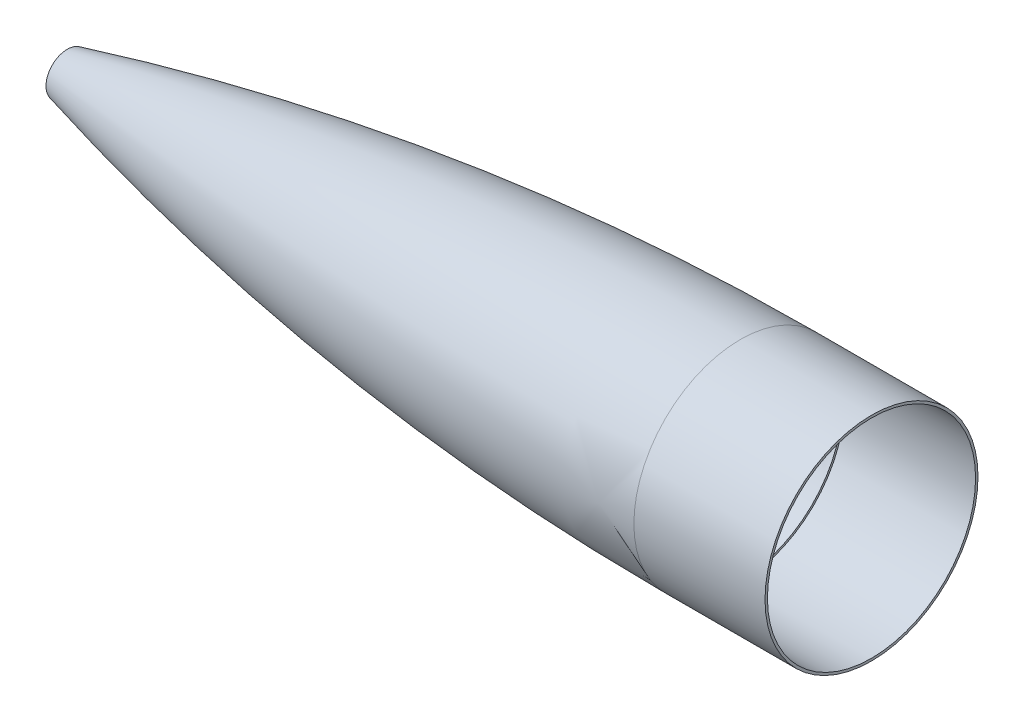
ISO-10303-21;
HEADER;
FILE_DESCRIPTION(('STEP AP214'),'2;1');
FILE_NAME('part.step','',(''),(''),'','','');
FILE_SCHEMA(('AUTOMOTIVE_DESIGN { 1 0 10303 214 1 1 1 1 }'));
ENDSEC;
DATA;
#1=APPLICATION_CONTEXT('core data for automotive mechanical design processes');
#2=APPLICATION_PROTOCOL_DEFINITION('international standard','automotive_design',2000,#1);
#3=PRODUCT_CONTEXT('',#1,'mechanical');
#4=PRODUCT('Part','Part','',(#3));
#5=PRODUCT_RELATED_PRODUCT_CATEGORY('part','',(#4));
#6=PRODUCT_DEFINITION_FORMATION('','',#4);
#7=PRODUCT_DEFINITION_CONTEXT('part definition',#1,'design');
#8=PRODUCT_DEFINITION('design','',#6,#7);
#9=PRODUCT_DEFINITION_SHAPE('','',#8);
#10=(LENGTH_UNIT() NAMED_UNIT(*) SI_UNIT(.MILLI.,.METRE.));
#11=(NAMED_UNIT(*) PLANE_ANGLE_UNIT() SI_UNIT($,.RADIAN.));
#12=(NAMED_UNIT(*) SI_UNIT($,.STERADIAN.) SOLID_ANGLE_UNIT());
#13=UNCERTAINTY_MEASURE_WITH_UNIT(LENGTH_MEASURE(1.E-05),#10,'distance_accuracy_value','');
#14=(GEOMETRIC_REPRESENTATION_CONTEXT(3) GLOBAL_UNCERTAINTY_ASSIGNED_CONTEXT((#13)) GLOBAL_UNIT_ASSIGNED_CONTEXT((#10,
#11,#12)) REPRESENTATION_CONTEXT('',''));
#15=CARTESIAN_POINT('',(0.,0.,0.));
#16=DIRECTION('',(0.,0.,1.));
#17=DIRECTION('',(1.,0.,0.));
#18=AXIS2_PLACEMENT_3D('',#15,#16,#17);
#19=CARTESIAN_POINT('',(0.,0.,0.));
#20=DIRECTION('',(-1.,0.,0.));
#21=DIRECTION('',(0.,0.,1.));
#22=AXIS2_PLACEMENT_3D('',#19,#20,#21);
#23=CYLINDRICAL_SURFACE('',#22,78.359);
#24=CARTESIAN_POINT('',(648.937499938,0.,0.));
#25=DIRECTION('',(-1.,0.,0.));
#26=DIRECTION('',(0.,0.,1.));
#27=AXIS2_PLACEMENT_3D('',#24,#25,#26);
#28=CIRCLE('',#27,78.359);
#29=CARTESIAN_POINT('',(648.937499938,0.,78.359));
#30=VERTEX_POINT('',#29);
#31=EDGE_CURVE('E67',#30,#30,#28,.F.);
#32=ORIENTED_EDGE('',*,*,#31,.F.);
#33=EDGE_LOOP('',(#32));
#34=FACE_BOUND('',#33,.T.);
#35=CARTESIAN_POINT('',(552.45,0.,0.));
#36=DIRECTION('',(-1.,0.,0.));
#37=DIRECTION('',(0.,0.,1.));
#38=AXIS2_PLACEMENT_3D('',#35,#36,#37);
#39=CIRCLE('',#38,78.359);
#40=CARTESIAN_POINT('',(552.45,0.,78.359));
#41=VERTEX_POINT('',#40);
#42=EDGE_CURVE('E10',#41,#41,#39,.T.);
#43=ORIENTED_EDGE('',*,*,#42,.F.);
#44=EDGE_LOOP('',(#43));
#45=FACE_BOUND('',#44,.T.);
#46=ADVANCED_FACE('F45',(#34,#45),#23,.T.);
#47=CARTESIAN_POINT('',(552.45,0.,0.));
#48=DIRECTION('',(-1.,0.,0.));
#49=DIRECTION('',(0.,0.,1.));
#50=AXIS2_PLACEMENT_3D('',#47,#48,#49);
#51=DEGENERATE_TOROIDAL_SURFACE('',#50,1908.27390356564,1986.63290356564,.F.);
#52=CARTESIAN_POINT('',(57.15,0.,0.));
#53=DIRECTION('',(-1.,0.,0.));
#54=DIRECTION('',(0.,0.,1.));
#55=AXIS2_PLACEMENT_3D('',#52,#53,#54);
#56=CIRCLE('',#55,15.6253150863259);
#57=CARTESIAN_POINT('',(57.15,0.,15.6253150863259));
#58=VERTEX_POINT('',#57);
#59=EDGE_CURVE('E52',#58,#58,#56,.T.);
#60=ORIENTED_EDGE('',*,*,#59,.F.);
#61=EDGE_LOOP('',(#60));
#62=FACE_BOUND('',#61,.T.);
#63=ORIENTED_EDGE('',*,*,#42,.T.);
#64=EDGE_LOOP('',(#63));
#65=FACE_BOUND('',#64,.T.);
#66=ADVANCED_FACE('F88',(#62,#65),#51,.F.);
#67=CARTESIAN_POINT('',(57.15,-1.26895932791568E-13,0.));
#68=DIRECTION('',(-1.,0.,0.));
#69=DIRECTION('',(0.,0.,1.));
#70=AXIS2_PLACEMENT_3D('',#67,#68,#69);
#71=PLANE('',#70);
#72=CARTESIAN_POINT('',(57.15,0.,0.));
#73=DIRECTION('',(-1.,0.,0.));
#74=DIRECTION('',(0.,0.,1.));
#75=AXIS2_PLACEMENT_3D('',#72,#73,#74);
#76=CIRCLE('',#75,12.2154567377433);
#77=CARTESIAN_POINT('',(57.15,0.,12.2154567377433));
#78=VERTEX_POINT('',#77);
#79=EDGE_CURVE('E56',#78,#78,#76,.T.);
#80=ORIENTED_EDGE('',*,*,#79,.F.);
#81=EDGE_LOOP('',(#80));
#82=FACE_BOUND('',#81,.T.);
#83=ORIENTED_EDGE('',*,*,#59,.T.);
#84=EDGE_LOOP('',(#83));
#85=FACE_BOUND('',#84,.T.);
#86=ADVANCED_FACE('F93',(#82,#85),#71,.T.);
#87=CARTESIAN_POINT('',(552.45,0.,0.));
#88=DIRECTION('',(-1.,0.,0.));
#89=DIRECTION('',(0.,0.,1.));
#90=AXIS2_PLACEMENT_3D('',#87,#88,#89);
#91=DEGENERATE_TOROIDAL_SURFACE('',#90,1908.27390356564,1983.33090356564,.F.);
#92=ORIENTED_EDGE('',*,*,#79,.T.);
#93=EDGE_LOOP('',(#92));
#94=FACE_BOUND('',#93,.T.);
#95=CARTESIAN_POINT('',(552.45,0.,0.));
#96=DIRECTION('',(1.,0.,0.));
#97=DIRECTION('',(0.,0.,-1.));
#98=AXIS2_PLACEMENT_3D('',#95,#96,#97);
#99=CIRCLE('',#98,75.0570000000002);
#100=CARTESIAN_POINT('',(552.45,0.,-75.0570000000002));
#101=VERTEX_POINT('',#100);
#102=EDGE_CURVE('E61',#101,#101,#99,.T.);
#103=ORIENTED_EDGE('',*,*,#102,.T.);
#104=EDGE_LOOP('',(#103));
#105=FACE_BOUND('',#104,.T.);
#106=ADVANCED_FACE('F99',(#94,#105),#91,.T.);
#107=CARTESIAN_POINT('',(552.45,0.,0.));
#108=DIRECTION('',(1.,0.,0.));
#109=DIRECTION('',(0.,0.,-1.));
#110=AXIS2_PLACEMENT_3D('',#107,#108,#109);
#111=CYLINDRICAL_SURFACE('',#110,76.581);
#112=CARTESIAN_POINT('',(648.937499938,0.,0.));
#113=DIRECTION('',(-1.,0.,0.));
#114=DIRECTION('',(0.,0.,1.));
#115=AXIS2_PLACEMENT_3D('',#112,#113,#114);
#116=CIRCLE('',#115,76.581);
#117=CARTESIAN_POINT('',(648.937499938,0.,76.581));
#118=VERTEX_POINT('',#117);
#119=EDGE_CURVE('E48',#118,#118,#116,.F.);
#120=ORIENTED_EDGE('',*,*,#119,.T.);
#121=EDGE_LOOP('',(#120));
#122=FACE_BOUND('',#121,.T.);
#123=CARTESIAN_POINT('',(552.45,0.,0.));
#124=DIRECTION('',(1.,0.,0.));
#125=DIRECTION('',(0.,0.,-1.));
#126=AXIS2_PLACEMENT_3D('',#123,#124,#125);
#127=CIRCLE('',#126,76.581);
#128=CARTESIAN_POINT('',(552.45,0.,-76.581));
#129=VERTEX_POINT('',#128);
#130=EDGE_CURVE('E64',#129,#129,#127,.T.);
#131=ORIENTED_EDGE('',*,*,#130,.F.);
#132=EDGE_LOOP('',(#131));
#133=FACE_BOUND('',#132,.T.);
#134=ADVANCED_FACE('F74',(#122,#133),#111,.F.);
#135=CARTESIAN_POINT('',(552.45,0.,0.));
#136=DIRECTION('',(1.,0.,0.));
#137=DIRECTION('',(0.,0.,-1.));
#138=AXIS2_PLACEMENT_3D('',#135,#136,#137);
#139=PLANE('',#138);
#140=ORIENTED_EDGE('',*,*,#102,.F.);
#141=EDGE_LOOP('',(#140));
#142=FACE_BOUND('',#141,.T.);
#143=ORIENTED_EDGE('',*,*,#130,.T.);
#144=EDGE_LOOP('',(#143));
#145=FACE_BOUND('',#144,.T.);
#146=ADVANCED_FACE('F79',(#142,#145),#139,.T.);
#147=CARTESIAN_POINT('',(648.937499938,-78.359,-78.3590000000001));
#148=DIRECTION('',(-1.,0.,0.));
#149=DIRECTION('',(0.,0.,1.));
#150=AXIS2_PLACEMENT_3D('',#147,#148,#149);
#151=PLANE('',#150);
#152=ORIENTED_EDGE('',*,*,#31,.T.);
#153=EDGE_LOOP('',(#152));
#154=FACE_BOUND('',#153,.T.);
#155=ORIENTED_EDGE('',*,*,#119,.F.);
#156=EDGE_LOOP('',(#155));
#157=FACE_BOUND('',#156,.T.);
#158=ADVANCED_FACE('F77',(#154,#157),#151,.F.);
#159=CLOSED_SHELL('',(#46,#66,#86,#106,#134,#146,#158));
#160=MANIFOLD_SOLID_BREP('B2',#159);
#161=ADVANCED_BREP_SHAPE_REPRESENTATION('',(#18,#160),#14);
#162=SHAPE_DEFINITION_REPRESENTATION(#9,#161);
ENDSEC;
END-ISO-10303-21;
